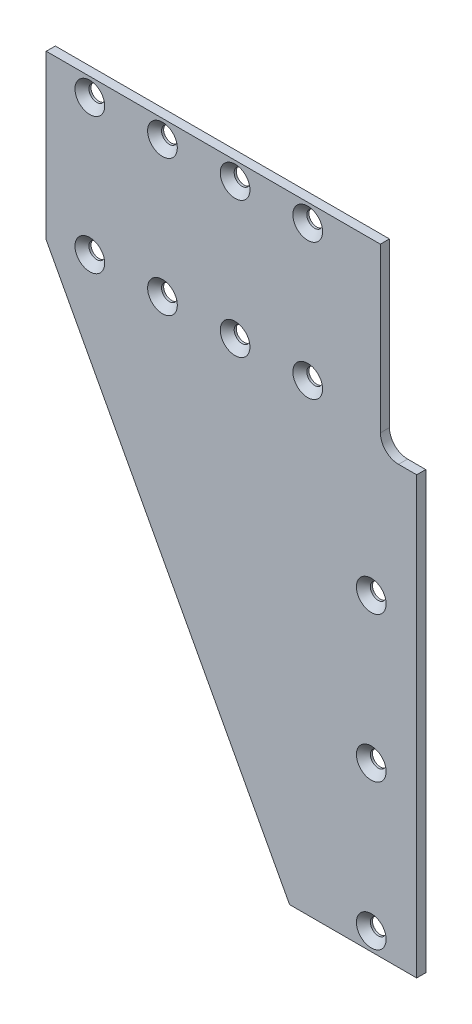
ISO-10303-21;
HEADER;
FILE_DESCRIPTION(('STEP AP214'),'2;1');
FILE_NAME('part.step','',(''),(''),'','','');
FILE_SCHEMA(('AUTOMOTIVE_DESIGN { 1 0 10303 214 1 1 1 1 }'));
ENDSEC;
DATA;
#1=APPLICATION_CONTEXT('core data for automotive mechanical design processes');
#2=APPLICATION_PROTOCOL_DEFINITION('international standard','automotive_design',2000,#1);
#3=PRODUCT_CONTEXT('',#1,'mechanical');
#4=PRODUCT('Part','Part','',(#3));
#5=PRODUCT_RELATED_PRODUCT_CATEGORY('part','',(#4));
#6=PRODUCT_DEFINITION_FORMATION('','',#4);
#7=PRODUCT_DEFINITION_CONTEXT('part definition',#1,'design');
#8=PRODUCT_DEFINITION('design','',#6,#7);
#9=PRODUCT_DEFINITION_SHAPE('','',#8);
#10=(LENGTH_UNIT() NAMED_UNIT(*) SI_UNIT(.MILLI.,.METRE.));
#11=(NAMED_UNIT(*) PLANE_ANGLE_UNIT() SI_UNIT($,.RADIAN.));
#12=(NAMED_UNIT(*) SI_UNIT($,.STERADIAN.) SOLID_ANGLE_UNIT());
#13=UNCERTAINTY_MEASURE_WITH_UNIT(LENGTH_MEASURE(1.E-05),#10,'distance_accuracy_value','');
#14=(GEOMETRIC_REPRESENTATION_CONTEXT(3) GLOBAL_UNCERTAINTY_ASSIGNED_CONTEXT((#13)) GLOBAL_UNIT_ASSIGNED_CONTEXT((#10,
#11,#12)) REPRESENTATION_CONTEXT('',''));
#15=CARTESIAN_POINT('',(0.,0.,0.));
#16=DIRECTION('',(0.,0.,1.));
#17=DIRECTION('',(1.,0.,0.));
#18=AXIS2_PLACEMENT_3D('',#15,#16,#17);
#19=CARTESIAN_POINT('',(-44.45,0.,-3.175));
#20=DIRECTION('',(0.,-1.,0.));
#21=DIRECTION('',(0.,0.,-1.));
#22=AXIS2_PLACEMENT_3D('',#19,#20,#21);
#23=PLANE('',#22);
#24=DIRECTION('',(1.,0.,0.));
#25=VECTOR('',#24,1.);
#26=CARTESIAN_POINT('',(-44.45,0.,0.));
#27=LINE('',#26,#25);
#28=CARTESIAN_POINT('',(-44.45,0.,0.));
#29=VERTEX_POINT('',#28);
#30=CARTESIAN_POINT('',(0.,0.,0.));
#31=VERTEX_POINT('',#30);
#32=EDGE_CURVE('E137',#29,#31,#27,.T.);
#33=ORIENTED_EDGE('',*,*,#32,.F.);
#34=DIRECTION('',(0.,0.,1.));
#35=VECTOR('',#34,1.);
#36=CARTESIAN_POINT('',(-44.45,0.,-3.175));
#37=LINE('',#36,#35);
#38=CARTESIAN_POINT('',(-44.45,0.,-3.175));
#39=VERTEX_POINT('',#38);
#40=EDGE_CURVE('E11',#39,#29,#37,.T.);
#41=ORIENTED_EDGE('',*,*,#40,.F.);
#42=DIRECTION('',(1.,0.,0.));
#43=VECTOR('',#42,1.);
#44=CARTESIAN_POINT('',(-44.45,0.,-3.175));
#45=LINE('',#44,#43);
#46=CARTESIAN_POINT('',(0.,0.,-3.175));
#47=VERTEX_POINT('',#46);
#48=EDGE_CURVE('E158',#39,#47,#45,.T.);
#49=ORIENTED_EDGE('',*,*,#48,.T.);
#50=DIRECTION('',(0.,0.,1.));
#51=VECTOR('',#50,1.);
#52=CARTESIAN_POINT('',(0.,0.,-3.175));
#53=LINE('',#52,#51);
#54=EDGE_CURVE('E43',#47,#31,#53,.T.);
#55=ORIENTED_EDGE('',*,*,#54,.T.);
#56=EDGE_LOOP('',(#33,#41,#49,#55));
#57=FACE_BOUND('',#56,.T.);
#58=ADVANCED_FACE('F40',(#57),#23,.T.);
#59=CARTESIAN_POINT('',(-129.54,158.75,-3.175));
#60=DIRECTION('',(-0.881375126691514,-0.472417067906652,0.));
#61=DIRECTION('',(0.472417067906652,-0.881375126691514,0.));
#62=AXIS2_PLACEMENT_3D('',#59,#60,#61);
#63=PLANE('',#62);
#64=DIRECTION('',(0.472417067906652,-0.881375126691514,0.));
#65=VECTOR('',#64,1.);
#66=CARTESIAN_POINT('',(-129.54,158.75,0.));
#67=LINE('',#66,#65);
#68=CARTESIAN_POINT('',(-129.54,158.75,0.));
#69=VERTEX_POINT('',#68);
#70=EDGE_CURVE('E156',#69,#29,#67,.T.);
#71=ORIENTED_EDGE('',*,*,#70,.F.);
#72=DIRECTION('',(0.,0.,1.));
#73=VECTOR('',#72,1.);
#74=CARTESIAN_POINT('',(-129.54,158.75,-3.175));
#75=LINE('',#74,#73);
#76=CARTESIAN_POINT('',(-129.54,158.75,-3.175));
#77=VERTEX_POINT('',#76);
#78=EDGE_CURVE('E49',#77,#69,#75,.T.);
#79=ORIENTED_EDGE('',*,*,#78,.F.);
#80=DIRECTION('',(0.472417067906652,-0.881375126691514,0.));
#81=VECTOR('',#80,1.);
#82=CARTESIAN_POINT('',(-129.54,158.75,-3.175));
#83=LINE('',#82,#81);
#84=EDGE_CURVE('E127',#77,#39,#83,.T.);
#85=ORIENTED_EDGE('',*,*,#84,.T.);
#86=ORIENTED_EDGE('',*,*,#40,.T.);
#87=EDGE_LOOP('',(#71,#79,#85,#86));
#88=FACE_BOUND('',#87,.T.);
#89=ADVANCED_FACE('F170',(#88),#63,.T.);
#90=CARTESIAN_POINT('',(-129.54,215.9,-3.175));
#91=DIRECTION('',(-1.,0.,0.));
#92=DIRECTION('',(0.,-1.,0.));
#93=AXIS2_PLACEMENT_3D('',#90,#91,#92);
#94=PLANE('',#93);
#95=DIRECTION('',(0.,-1.,0.));
#96=VECTOR('',#95,1.);
#97=CARTESIAN_POINT('',(-129.54,215.9,0.));
#98=LINE('',#97,#96);
#99=CARTESIAN_POINT('',(-129.54,215.9,0.));
#100=VERTEX_POINT('',#99);
#101=EDGE_CURVE('E114',#100,#69,#98,.T.);
#102=ORIENTED_EDGE('',*,*,#101,.F.);
#103=DIRECTION('',(0.,0.,1.));
#104=VECTOR('',#103,1.);
#105=CARTESIAN_POINT('',(-129.54,215.9,-3.175));
#106=LINE('',#105,#104);
#107=CARTESIAN_POINT('',(-129.54,215.9,-3.175));
#108=VERTEX_POINT('',#107);
#109=EDGE_CURVE('E109',#108,#100,#106,.T.);
#110=ORIENTED_EDGE('',*,*,#109,.F.);
#111=DIRECTION('',(0.,-1.,0.));
#112=VECTOR('',#111,1.);
#113=CARTESIAN_POINT('',(-129.54,215.9,-3.175));
#114=LINE('',#113,#112);
#115=EDGE_CURVE('E112',#108,#77,#114,.T.);
#116=ORIENTED_EDGE('',*,*,#115,.T.);
#117=ORIENTED_EDGE('',*,*,#78,.T.);
#118=EDGE_LOOP('',(#102,#110,#116,#117));
#119=FACE_BOUND('',#118,.T.);
#120=ADVANCED_FACE('F111',(#119),#94,.T.);
#121=CARTESIAN_POINT('',(-12.7,215.9,-3.175));
#122=DIRECTION('',(0.,1.,0.));
#123=DIRECTION('',(-1.,0.,0.));
#124=AXIS2_PLACEMENT_3D('',#121,#122,#123);
#125=PLANE('',#124);
#126=DIRECTION('',(-1.,0.,0.));
#127=VECTOR('',#126,1.);
#128=CARTESIAN_POINT('',(-12.7,215.9,0.));
#129=LINE('',#128,#127);
#130=CARTESIAN_POINT('',(-12.7,215.9,0.));
#131=VERTEX_POINT('',#130);
#132=EDGE_CURVE('E153',#131,#100,#129,.T.);
#133=ORIENTED_EDGE('',*,*,#132,.F.);
#134=DIRECTION('',(0.,0.,1.));
#135=VECTOR('',#134,1.);
#136=CARTESIAN_POINT('',(-12.7,215.9,-3.175));
#137=LINE('',#136,#135);
#138=CARTESIAN_POINT('',(-12.7,215.9,-3.175));
#139=VERTEX_POINT('',#138);
#140=EDGE_CURVE('E119',#139,#131,#137,.T.);
#141=ORIENTED_EDGE('',*,*,#140,.F.);
#142=DIRECTION('',(-1.,0.,0.));
#143=VECTOR('',#142,1.);
#144=CARTESIAN_POINT('',(-12.7,215.9,-3.175));
#145=LINE('',#144,#143);
#146=EDGE_CURVE('E125',#139,#108,#145,.T.);
#147=ORIENTED_EDGE('',*,*,#146,.T.);
#148=ORIENTED_EDGE('',*,*,#109,.T.);
#149=EDGE_LOOP('',(#133,#141,#147,#148));
#150=FACE_BOUND('',#149,.T.);
#151=ADVANCED_FACE('F129',(#150),#125,.T.);
#152=CARTESIAN_POINT('',(-12.7,215.9,-3.175));
#153=DIRECTION('',(1.,0.,0.));
#154=DIRECTION('',(0.,1.,0.));
#155=AXIS2_PLACEMENT_3D('',#152,#153,#154);
#156=PLANE('',#155);
#157=DIRECTION('',(0.,1.,0.));
#158=VECTOR('',#157,1.);
#159=CARTESIAN_POINT('',(-12.7,215.9,0.));
#160=LINE('',#159,#158);
#161=CARTESIAN_POINT('',(-12.7,158.75,0.));
#162=VERTEX_POINT('',#161);
#163=EDGE_CURVE('E150',#162,#131,#160,.T.);
#164=ORIENTED_EDGE('',*,*,#163,.F.);
#165=DIRECTION('',(0.,0.,1.));
#166=VECTOR('',#165,1.);
#167=CARTESIAN_POINT('',(-12.7,158.75,-3.175));
#168=LINE('',#167,#166);
#169=CARTESIAN_POINT('',(-12.7,158.75,-3.175));
#170=VERTEX_POINT('',#169);
#171=EDGE_CURVE('E162',#170,#162,#168,.T.);
#172=ORIENTED_EDGE('',*,*,#171,.F.);
#173=DIRECTION('',(0.,1.,0.));
#174=VECTOR('',#173,1.);
#175=CARTESIAN_POINT('',(-12.7,215.9,-3.175));
#176=LINE('',#175,#174);
#177=EDGE_CURVE('E130',#170,#139,#176,.T.);
#178=ORIENTED_EDGE('',*,*,#177,.T.);
#179=ORIENTED_EDGE('',*,*,#140,.T.);
#180=EDGE_LOOP('',(#164,#172,#178,#179));
#181=FACE_BOUND('',#180,.T.);
#182=ADVANCED_FACE('F183',(#181),#156,.T.);
#183=CARTESIAN_POINT('',(-6.35,158.75,-3.175));
#184=DIRECTION('',(0.,0.,1.));
#185=DIRECTION('',(1.,0.,0.));
#186=AXIS2_PLACEMENT_3D('',#183,#184,#185);
#187=CYLINDRICAL_SURFACE('',#186,6.35);
#188=CARTESIAN_POINT('',(-6.35,158.75,0.));
#189=DIRECTION('',(0.,0.,-1.));
#190=DIRECTION('',(1.,0.,0.));
#191=AXIS2_PLACEMENT_3D('',#188,#189,#190);
#192=CIRCLE('',#191,6.35);
#193=CARTESIAN_POINT('',(-6.34999999999994,152.4,0.));
#194=VERTEX_POINT('',#193);
#195=EDGE_CURVE('E147',#194,#162,#192,.T.);
#196=ORIENTED_EDGE('',*,*,#195,.F.);
#197=DIRECTION('',(0.,0.,1.));
#198=VECTOR('',#197,1.);
#199=CARTESIAN_POINT('',(-6.34999999999994,152.4,-3.175));
#200=LINE('',#199,#198);
#201=CARTESIAN_POINT('',(-6.34999999999994,152.4,-3.175));
#202=VERTEX_POINT('',#201);
#203=EDGE_CURVE('E164',#202,#194,#200,.T.);
#204=ORIENTED_EDGE('',*,*,#203,.F.);
#205=CARTESIAN_POINT('',(-6.35,158.75,-3.175));
#206=DIRECTION('',(0.,0.,-1.));
#207=DIRECTION('',(1.,0.,0.));
#208=AXIS2_PLACEMENT_3D('',#205,#206,#207);
#209=CIRCLE('',#208,6.35);
#210=EDGE_CURVE('E132',#202,#170,#209,.T.);
#211=ORIENTED_EDGE('',*,*,#210,.T.);
#212=ORIENTED_EDGE('',*,*,#171,.T.);
#213=EDGE_LOOP('',(#196,#204,#211,#212));
#214=FACE_BOUND('',#213,.T.);
#215=ADVANCED_FACE('F186',(#214),#187,.F.);
#216=CARTESIAN_POINT('',(-6.34999999999994,152.4,-3.175));
#217=DIRECTION('',(0.,1.,0.));
#218=DIRECTION('',(0.,0.,1.));
#219=AXIS2_PLACEMENT_3D('',#216,#217,#218);
#220=PLANE('',#219);
#221=DIRECTION('',(-1.,0.,0.));
#222=VECTOR('',#221,1.);
#223=CARTESIAN_POINT('',(-6.34999999999994,152.4,0.));
#224=LINE('',#223,#222);
#225=CARTESIAN_POINT('',(0.,152.4,0.));
#226=VERTEX_POINT('',#225);
#227=EDGE_CURVE('E144',#226,#194,#224,.T.);
#228=ORIENTED_EDGE('',*,*,#227,.F.);
#229=DIRECTION('',(0.,0.,1.));
#230=VECTOR('',#229,1.);
#231=CARTESIAN_POINT('',(0.,152.4,-3.175));
#232=LINE('',#231,#230);
#233=CARTESIAN_POINT('',(0.,152.4,-3.175));
#234=VERTEX_POINT('',#233);
#235=EDGE_CURVE('E165',#234,#226,#232,.T.);
#236=ORIENTED_EDGE('',*,*,#235,.F.);
#237=DIRECTION('',(-1.,0.,0.));
#238=VECTOR('',#237,1.);
#239=CARTESIAN_POINT('',(-6.34999999999994,152.4,-3.175));
#240=LINE('',#239,#238);
#241=EDGE_CURVE('E399',#234,#202,#240,.T.);
#242=ORIENTED_EDGE('',*,*,#241,.T.);
#243=ORIENTED_EDGE('',*,*,#203,.T.);
#244=EDGE_LOOP('',(#228,#236,#242,#243));
#245=FACE_BOUND('',#244,.T.);
#246=ADVANCED_FACE('F190',(#245),#220,.T.);
#247=CARTESIAN_POINT('',(0.,0.,-3.175));
#248=DIRECTION('',(1.,0.,0.));
#249=DIRECTION('',(0.,0.,-1.));
#250=AXIS2_PLACEMENT_3D('',#247,#248,#249);
#251=PLANE('',#250);
#252=DIRECTION('',(0.,1.,0.));
#253=VECTOR('',#252,1.);
#254=CARTESIAN_POINT('',(0.,0.,0.));
#255=LINE('',#254,#253);
#256=EDGE_CURVE('E140',#31,#226,#255,.T.);
#257=ORIENTED_EDGE('',*,*,#256,.F.);
#258=ORIENTED_EDGE('',*,*,#54,.F.);
#259=DIRECTION('',(0.,1.,0.));
#260=VECTOR('',#259,1.);
#261=CARTESIAN_POINT('',(0.,0.,-3.175));
#262=LINE('',#261,#260);
#263=EDGE_CURVE('E397',#47,#234,#262,.T.);
#264=ORIENTED_EDGE('',*,*,#263,.T.);
#265=ORIENTED_EDGE('',*,*,#235,.T.);
#266=EDGE_LOOP('',(#257,#258,#264,#265));
#267=FACE_BOUND('',#266,.T.);
#268=ADVANCED_FACE('F167',(#267),#251,.T.);
#269=CARTESIAN_POINT('',(-6.35,158.75,-3.175));
#270=DIRECTION('',(0.,0.,1.));
#271=DIRECTION('',(1.,0.,0.));
#272=AXIS2_PLACEMENT_3D('',#269,#270,#271);
#273=PLANE('',#272);
#274=CARTESIAN_POINT('',(-15.875,6.34999999999999,-3.175));
#275=DIRECTION('',(0.,0.,1.));
#276=DIRECTION('',(1.,0.,0.));
#277=AXIS2_PLACEMENT_3D('',#274,#275,#276);
#278=CIRCLE('',#277,2.75589999999999);
#279=CARTESIAN_POINT('',(-13.1191,6.34999999999999,-3.175));
#280=VERTEX_POINT('',#279);
#281=EDGE_CURVE('E303',#280,#280,#278,.T.);
#282=ORIENTED_EDGE('',*,*,#281,.T.);
#283=EDGE_LOOP('',(#282));
#284=FACE_BOUND('',#283,.T.);
#285=CARTESIAN_POINT('',(-15.875,57.15,-3.175));
#286=DIRECTION('',(0.,0.,1.));
#287=DIRECTION('',(1.,0.,0.));
#288=AXIS2_PLACEMENT_3D('',#285,#286,#287);
#289=CIRCLE('',#288,2.75589999999999);
#290=CARTESIAN_POINT('',(-13.1191,57.15,-3.175));
#291=VERTEX_POINT('',#290);
#292=EDGE_CURVE('E313',#291,#291,#289,.T.);
#293=ORIENTED_EDGE('',*,*,#292,.T.);
#294=EDGE_LOOP('',(#293));
#295=FACE_BOUND('',#294,.T.);
#296=CARTESIAN_POINT('',(-15.875,107.95,-3.175));
#297=DIRECTION('',(0.,0.,1.));
#298=DIRECTION('',(1.,0.,0.));
#299=AXIS2_PLACEMENT_3D('',#296,#297,#298);
#300=CIRCLE('',#299,2.75589999999999);
#301=CARTESIAN_POINT('',(-13.1191,107.95,-3.175));
#302=VERTEX_POINT('',#301);
#303=EDGE_CURVE('E322',#302,#302,#300,.T.);
#304=ORIENTED_EDGE('',*,*,#303,.T.);
#305=EDGE_LOOP('',(#304));
#306=FACE_BOUND('',#305,.T.);
#307=CARTESIAN_POINT('',(-38.1,209.55,-3.175));
#308=DIRECTION('',(0.,0.,1.));
#309=DIRECTION('',(1.,0.,0.));
#310=AXIS2_PLACEMENT_3D('',#307,#308,#309);
#311=CIRCLE('',#310,2.7559);
#312=CARTESIAN_POINT('',(-35.3441,209.55,-3.175));
#313=VERTEX_POINT('',#312);
#314=EDGE_CURVE('E331',#313,#313,#311,.T.);
#315=ORIENTED_EDGE('',*,*,#314,.T.);
#316=EDGE_LOOP('',(#315));
#317=FACE_BOUND('',#316,.T.);
#318=CARTESIAN_POINT('',(-38.1,161.925,-3.175));
#319=DIRECTION('',(0.,0.,1.));
#320=DIRECTION('',(1.,0.,0.));
#321=AXIS2_PLACEMENT_3D('',#318,#319,#320);
#322=CIRCLE('',#321,2.7559);
#323=CARTESIAN_POINT('',(-35.3441,161.925,-3.175));
#324=VERTEX_POINT('',#323);
#325=EDGE_CURVE('E340',#324,#324,#322,.T.);
#326=ORIENTED_EDGE('',*,*,#325,.T.);
#327=EDGE_LOOP('',(#326));
#328=FACE_BOUND('',#327,.T.);
#329=CARTESIAN_POINT('',(-63.5,209.55,-3.175));
#330=DIRECTION('',(0.,0.,1.));
#331=DIRECTION('',(1.,0.,0.));
#332=AXIS2_PLACEMENT_3D('',#329,#330,#331);
#333=CIRCLE('',#332,2.7559);
#334=CARTESIAN_POINT('',(-60.7441,209.55,-3.175));
#335=VERTEX_POINT('',#334);
#336=EDGE_CURVE('E349',#335,#335,#333,.T.);
#337=ORIENTED_EDGE('',*,*,#336,.T.);
#338=EDGE_LOOP('',(#337));
#339=FACE_BOUND('',#338,.T.);
#340=CARTESIAN_POINT('',(-63.5,161.925,-3.175));
#341=DIRECTION('',(0.,0.,1.));
#342=DIRECTION('',(1.,0.,0.));
#343=AXIS2_PLACEMENT_3D('',#340,#341,#342);
#344=CIRCLE('',#343,2.7559);
#345=CARTESIAN_POINT('',(-60.7441,161.925,-3.175));
#346=VERTEX_POINT('',#345);
#347=EDGE_CURVE('E358',#346,#346,#344,.T.);
#348=ORIENTED_EDGE('',*,*,#347,.T.);
#349=EDGE_LOOP('',(#348));
#350=FACE_BOUND('',#349,.T.);
#351=CARTESIAN_POINT('',(-88.9,209.55,-3.175));
#352=DIRECTION('',(0.,0.,1.));
#353=DIRECTION('',(1.,0.,0.));
#354=AXIS2_PLACEMENT_3D('',#351,#352,#353);
#355=CIRCLE('',#354,2.75590000000001);
#356=CARTESIAN_POINT('',(-86.1441,209.55,-3.175));
#357=VERTEX_POINT('',#356);
#358=EDGE_CURVE('E367',#357,#357,#355,.T.);
#359=ORIENTED_EDGE('',*,*,#358,.T.);
#360=EDGE_LOOP('',(#359));
#361=FACE_BOUND('',#360,.T.);
#362=CARTESIAN_POINT('',(-88.9,161.925,-3.175));
#363=DIRECTION('',(0.,0.,1.));
#364=DIRECTION('',(1.,0.,0.));
#365=AXIS2_PLACEMENT_3D('',#362,#363,#364);
#366=CIRCLE('',#365,2.75590000000001);
#367=CARTESIAN_POINT('',(-86.1441,161.925,-3.175));
#368=VERTEX_POINT('',#367);
#369=EDGE_CURVE('E376',#368,#368,#366,.T.);
#370=ORIENTED_EDGE('',*,*,#369,.T.);
#371=EDGE_LOOP('',(#370));
#372=FACE_BOUND('',#371,.T.);
#373=CARTESIAN_POINT('',(-114.3,209.55,-3.175));
#374=DIRECTION('',(0.,0.,1.));
#375=DIRECTION('',(1.,0.,0.));
#376=AXIS2_PLACEMENT_3D('',#373,#374,#375);
#377=CIRCLE('',#376,2.75590000000001);
#378=CARTESIAN_POINT('',(-111.5441,209.55,-3.175));
#379=VERTEX_POINT('',#378);
#380=EDGE_CURVE('E385',#379,#379,#377,.T.);
#381=ORIENTED_EDGE('',*,*,#380,.T.);
#382=EDGE_LOOP('',(#381));
#383=FACE_BOUND('',#382,.T.);
#384=CARTESIAN_POINT('',(-114.3,161.925,-3.175));
#385=DIRECTION('',(0.,0.,1.));
#386=DIRECTION('',(1.,0.,0.));
#387=AXIS2_PLACEMENT_3D('',#384,#385,#386);
#388=CIRCLE('',#387,2.75590000000001);
#389=CARTESIAN_POINT('',(-111.5441,161.925,-3.175));
#390=VERTEX_POINT('',#389);
#391=EDGE_CURVE('E141',#390,#390,#388,.T.);
#392=ORIENTED_EDGE('',*,*,#391,.T.);
#393=EDGE_LOOP('',(#392));
#394=FACE_BOUND('',#393,.T.);
#395=ORIENTED_EDGE('',*,*,#48,.F.);
#396=ORIENTED_EDGE('',*,*,#84,.F.);
#397=ORIENTED_EDGE('',*,*,#115,.F.);
#398=ORIENTED_EDGE('',*,*,#146,.F.);
#399=ORIENTED_EDGE('',*,*,#177,.F.);
#400=ORIENTED_EDGE('',*,*,#210,.F.);
#401=ORIENTED_EDGE('',*,*,#241,.F.);
#402=ORIENTED_EDGE('',*,*,#263,.F.);
#403=EDGE_LOOP('',(#395,#396,#397,#398,#399,#400,#401,#402));
#404=FACE_BOUND('',#403,.T.);
#405=ADVANCED_FACE('F123',(#284,#295,#306,#317,#328,#339,#350,#361,#372,#383,#394,#404),#273,.F.);
#406=CARTESIAN_POINT('',(-6.35,158.75,0.));
#407=DIRECTION('',(0.,0.,1.));
#408=DIRECTION('',(1.,0.,0.));
#409=AXIS2_PLACEMENT_3D('',#406,#407,#408);
#410=PLANE('',#409);
#411=CARTESIAN_POINT('',(-15.875,6.34999999999999,0.));
#412=DIRECTION('',(0.,0.,1.));
#413=DIRECTION('',(1.,0.,0.));
#414=AXIS2_PLACEMENT_3D('',#411,#412,#413);
#415=CIRCLE('',#414,5.1943);
#416=CARTESIAN_POINT('',(-10.6807,6.34999999999999,0.));
#417=VERTEX_POINT('',#416);
#418=EDGE_CURVE('E301',#417,#417,#415,.T.);
#419=ORIENTED_EDGE('',*,*,#418,.F.);
#420=EDGE_LOOP('',(#419));
#421=FACE_BOUND('',#420,.T.);
#422=CARTESIAN_POINT('',(-15.875,57.15,0.));
#423=DIRECTION('',(0.,0.,1.));
#424=DIRECTION('',(1.,0.,0.));
#425=AXIS2_PLACEMENT_3D('',#422,#423,#424);
#426=CIRCLE('',#425,5.1943);
#427=CARTESIAN_POINT('',(-10.6807,57.15,0.));
#428=VERTEX_POINT('',#427);
#429=EDGE_CURVE('E307',#428,#428,#426,.T.);
#430=ORIENTED_EDGE('',*,*,#429,.F.);
#431=EDGE_LOOP('',(#430));
#432=FACE_BOUND('',#431,.T.);
#433=CARTESIAN_POINT('',(-15.875,107.95,0.));
#434=DIRECTION('',(0.,0.,1.));
#435=DIRECTION('',(1.,0.,0.));
#436=AXIS2_PLACEMENT_3D('',#433,#434,#435);
#437=CIRCLE('',#436,5.1943);
#438=CARTESIAN_POINT('',(-10.6807,107.95,0.));
#439=VERTEX_POINT('',#438);
#440=EDGE_CURVE('E316',#439,#439,#437,.T.);
#441=ORIENTED_EDGE('',*,*,#440,.F.);
#442=EDGE_LOOP('',(#441));
#443=FACE_BOUND('',#442,.T.);
#444=CARTESIAN_POINT('',(-38.1,209.55,0.));
#445=DIRECTION('',(0.,0.,1.));
#446=DIRECTION('',(1.,0.,0.));
#447=AXIS2_PLACEMENT_3D('',#444,#445,#446);
#448=CIRCLE('',#447,5.1943);
#449=CARTESIAN_POINT('',(-32.9057,209.55,0.));
#450=VERTEX_POINT('',#449);
#451=EDGE_CURVE('E325',#450,#450,#448,.T.);
#452=ORIENTED_EDGE('',*,*,#451,.F.);
#453=EDGE_LOOP('',(#452));
#454=FACE_BOUND('',#453,.T.);
#455=CARTESIAN_POINT('',(-38.1,161.925,0.));
#456=DIRECTION('',(0.,0.,1.));
#457=DIRECTION('',(1.,0.,0.));
#458=AXIS2_PLACEMENT_3D('',#455,#456,#457);
#459=CIRCLE('',#458,5.1943);
#460=CARTESIAN_POINT('',(-32.9057,161.925,0.));
#461=VERTEX_POINT('',#460);
#462=EDGE_CURVE('E334',#461,#461,#459,.T.);
#463=ORIENTED_EDGE('',*,*,#462,.F.);
#464=EDGE_LOOP('',(#463));
#465=FACE_BOUND('',#464,.T.);
#466=CARTESIAN_POINT('',(-63.5,209.55,0.));
#467=DIRECTION('',(0.,0.,1.));
#468=DIRECTION('',(1.,0.,0.));
#469=AXIS2_PLACEMENT_3D('',#466,#467,#468);
#470=CIRCLE('',#469,5.1943);
#471=CARTESIAN_POINT('',(-58.3057,209.55,0.));
#472=VERTEX_POINT('',#471);
#473=EDGE_CURVE('E343',#472,#472,#470,.T.);
#474=ORIENTED_EDGE('',*,*,#473,.F.);
#475=EDGE_LOOP('',(#474));
#476=FACE_BOUND('',#475,.T.);
#477=CARTESIAN_POINT('',(-63.5,161.925,0.));
#478=DIRECTION('',(0.,0.,1.));
#479=DIRECTION('',(1.,0.,0.));
#480=AXIS2_PLACEMENT_3D('',#477,#478,#479);
#481=CIRCLE('',#480,5.1943);
#482=CARTESIAN_POINT('',(-58.3057,161.925,0.));
#483=VERTEX_POINT('',#482);
#484=EDGE_CURVE('E352',#483,#483,#481,.T.);
#485=ORIENTED_EDGE('',*,*,#484,.F.);
#486=EDGE_LOOP('',(#485));
#487=FACE_BOUND('',#486,.T.);
#488=CARTESIAN_POINT('',(-88.9,209.55,0.));
#489=DIRECTION('',(0.,0.,1.));
#490=DIRECTION('',(1.,0.,0.));
#491=AXIS2_PLACEMENT_3D('',#488,#489,#490);
#492=CIRCLE('',#491,5.1943);
#493=CARTESIAN_POINT('',(-83.7057,209.55,0.));
#494=VERTEX_POINT('',#493);
#495=EDGE_CURVE('E361',#494,#494,#492,.T.);
#496=ORIENTED_EDGE('',*,*,#495,.F.);
#497=EDGE_LOOP('',(#496));
#498=FACE_BOUND('',#497,.T.);
#499=CARTESIAN_POINT('',(-88.9,161.925,0.));
#500=DIRECTION('',(0.,0.,1.));
#501=DIRECTION('',(1.,0.,0.));
#502=AXIS2_PLACEMENT_3D('',#499,#500,#501);
#503=CIRCLE('',#502,5.1943);
#504=CARTESIAN_POINT('',(-83.7057,161.925,0.));
#505=VERTEX_POINT('',#504);
#506=EDGE_CURVE('E370',#505,#505,#503,.T.);
#507=ORIENTED_EDGE('',*,*,#506,.F.);
#508=EDGE_LOOP('',(#507));
#509=FACE_BOUND('',#508,.T.);
#510=CARTESIAN_POINT('',(-114.3,209.55,0.));
#511=DIRECTION('',(0.,0.,1.));
#512=DIRECTION('',(1.,0.,0.));
#513=AXIS2_PLACEMENT_3D('',#510,#511,#512);
#514=CIRCLE('',#513,5.1943);
#515=CARTESIAN_POINT('',(-109.1057,209.55,0.));
#516=VERTEX_POINT('',#515);
#517=EDGE_CURVE('E379',#516,#516,#514,.T.);
#518=ORIENTED_EDGE('',*,*,#517,.F.);
#519=EDGE_LOOP('',(#518));
#520=FACE_BOUND('',#519,.T.);
#521=CARTESIAN_POINT('',(-114.3,161.925,0.));
#522=DIRECTION('',(0.,0.,1.));
#523=DIRECTION('',(1.,0.,0.));
#524=AXIS2_PLACEMENT_3D('',#521,#522,#523);
#525=CIRCLE('',#524,5.1943);
#526=CARTESIAN_POINT('',(-109.1057,161.925,0.));
#527=VERTEX_POINT('',#526);
#528=EDGE_CURVE('E388',#527,#527,#525,.T.);
#529=ORIENTED_EDGE('',*,*,#528,.F.);
#530=EDGE_LOOP('',(#529));
#531=FACE_BOUND('',#530,.T.);
#532=ORIENTED_EDGE('',*,*,#32,.T.);
#533=ORIENTED_EDGE('',*,*,#256,.T.);
#534=ORIENTED_EDGE('',*,*,#227,.T.);
#535=ORIENTED_EDGE('',*,*,#195,.T.);
#536=ORIENTED_EDGE('',*,*,#163,.T.);
#537=ORIENTED_EDGE('',*,*,#132,.T.);
#538=ORIENTED_EDGE('',*,*,#101,.T.);
#539=ORIENTED_EDGE('',*,*,#70,.T.);
#540=EDGE_LOOP('',(#532,#533,#534,#535,#536,#537,#538,#539));
#541=FACE_BOUND('',#540,.T.);
#542=ADVANCED_FACE('F169',(#421,#432,#443,#454,#465,#476,#487,#498,#509,#520,#531,#541),#410,.T.);
#543=CARTESIAN_POINT('',(-114.3,161.925,0.));
#544=DIRECTION('',(0.,0.,1.));
#545=DIRECTION('',(1.,0.,0.));
#546=AXIS2_PLACEMENT_3D('',#543,#544,#545);
#547=CYLINDRICAL_SURFACE('',#546,2.75590000000001);
#548=ORIENTED_EDGE('',*,*,#391,.F.);
#549=EDGE_LOOP('',(#548));
#550=FACE_BOUND('',#549,.T.);
#551=CARTESIAN_POINT('',(-114.3,161.925,-2.4384));
#552=DIRECTION('',(0.,0.,1.));
#553=DIRECTION('',(1.,0.,0.));
#554=AXIS2_PLACEMENT_3D('',#551,#552,#553);
#555=CIRCLE('',#554,2.75590000000001);
#556=CARTESIAN_POINT('',(-111.5441,161.925,-2.4384));
#557=VERTEX_POINT('',#556);
#558=EDGE_CURVE('E391',#557,#557,#555,.T.);
#559=ORIENTED_EDGE('',*,*,#558,.T.);
#560=EDGE_LOOP('',(#559));
#561=FACE_BOUND('',#560,.T.);
#562=ADVANCED_FACE('F202',(#550,#561),#547,.F.);
#563=CARTESIAN_POINT('',(-114.3,161.925,0.));
#564=DIRECTION('',(0.,0.,1.));
#565=DIRECTION('',(1.,0.,0.));
#566=AXIS2_PLACEMENT_3D('',#563,#564,#565);
#567=CONICAL_SURFACE('',#566,5.1943,0.785398163397447);
#568=ORIENTED_EDGE('',*,*,#558,.F.);
#569=EDGE_LOOP('',(#568));
#570=FACE_BOUND('',#569,.T.);
#571=ORIENTED_EDGE('',*,*,#528,.T.);
#572=EDGE_LOOP('',(#571));
#573=FACE_BOUND('',#572,.T.);
#574=ADVANCED_FACE('F209',(#570,#573),#567,.F.);
#575=CARTESIAN_POINT('',(-114.3,209.55,0.));
#576=DIRECTION('',(0.,0.,1.));
#577=DIRECTION('',(1.,0.,0.));
#578=AXIS2_PLACEMENT_3D('',#575,#576,#577);
#579=CYLINDRICAL_SURFACE('',#578,2.75590000000001);
#580=ORIENTED_EDGE('',*,*,#380,.F.);
#581=EDGE_LOOP('',(#580));
#582=FACE_BOUND('',#581,.T.);
#583=CARTESIAN_POINT('',(-114.3,209.55,-2.4384));
#584=DIRECTION('',(0.,0.,1.));
#585=DIRECTION('',(1.,0.,0.));
#586=AXIS2_PLACEMENT_3D('',#583,#584,#585);
#587=CIRCLE('',#586,2.75590000000001);
#588=CARTESIAN_POINT('',(-111.5441,209.55,-2.4384));
#589=VERTEX_POINT('',#588);
#590=EDGE_CURVE('E382',#589,#589,#587,.T.);
#591=ORIENTED_EDGE('',*,*,#590,.T.);
#592=EDGE_LOOP('',(#591));
#593=FACE_BOUND('',#592,.T.);
#594=ADVANCED_FACE('F213',(#582,#593),#579,.F.);
#595=CARTESIAN_POINT('',(-114.3,209.55,0.));
#596=DIRECTION('',(0.,0.,1.));
#597=DIRECTION('',(1.,0.,0.));
#598=AXIS2_PLACEMENT_3D('',#595,#596,#597);
#599=CONICAL_SURFACE('',#598,5.1943,0.785398163397447);
#600=ORIENTED_EDGE('',*,*,#590,.F.);
#601=EDGE_LOOP('',(#600));
#602=FACE_BOUND('',#601,.T.);
#603=ORIENTED_EDGE('',*,*,#517,.T.);
#604=EDGE_LOOP('',(#603));
#605=FACE_BOUND('',#604,.T.);
#606=ADVANCED_FACE('F217',(#602,#605),#599,.F.);
#607=CARTESIAN_POINT('',(-88.9,161.925,0.));
#608=DIRECTION('',(0.,0.,1.));
#609=DIRECTION('',(1.,0.,0.));
#610=AXIS2_PLACEMENT_3D('',#607,#608,#609);
#611=CYLINDRICAL_SURFACE('',#610,2.75590000000001);
#612=ORIENTED_EDGE('',*,*,#369,.F.);
#613=EDGE_LOOP('',(#612));
#614=FACE_BOUND('',#613,.T.);
#615=CARTESIAN_POINT('',(-88.9,161.925,-2.4384));
#616=DIRECTION('',(0.,0.,1.));
#617=DIRECTION('',(1.,0.,0.));
#618=AXIS2_PLACEMENT_3D('',#615,#616,#617);
#619=CIRCLE('',#618,2.75590000000001);
#620=CARTESIAN_POINT('',(-86.1441,161.925,-2.4384));
#621=VERTEX_POINT('',#620);
#622=EDGE_CURVE('E373',#621,#621,#619,.T.);
#623=ORIENTED_EDGE('',*,*,#622,.T.);
#624=EDGE_LOOP('',(#623));
#625=FACE_BOUND('',#624,.T.);
#626=ADVANCED_FACE('F221',(#614,#625),#611,.F.);
#627=CARTESIAN_POINT('',(-88.9,161.925,0.));
#628=DIRECTION('',(0.,0.,1.));
#629=DIRECTION('',(1.,0.,0.));
#630=AXIS2_PLACEMENT_3D('',#627,#628,#629);
#631=CONICAL_SURFACE('',#630,5.1943,0.785398163397447);
#632=ORIENTED_EDGE('',*,*,#622,.F.);
#633=EDGE_LOOP('',(#632));
#634=FACE_BOUND('',#633,.T.);
#635=ORIENTED_EDGE('',*,*,#506,.T.);
#636=EDGE_LOOP('',(#635));
#637=FACE_BOUND('',#636,.T.);
#638=ADVANCED_FACE('F225',(#634,#637),#631,.F.);
#639=CARTESIAN_POINT('',(-88.9,209.55,0.));
#640=DIRECTION('',(0.,0.,1.));
#641=DIRECTION('',(1.,0.,0.));
#642=AXIS2_PLACEMENT_3D('',#639,#640,#641);
#643=CYLINDRICAL_SURFACE('',#642,2.75590000000001);
#644=ORIENTED_EDGE('',*,*,#358,.F.);
#645=EDGE_LOOP('',(#644));
#646=FACE_BOUND('',#645,.T.);
#647=CARTESIAN_POINT('',(-88.9,209.55,-2.4384));
#648=DIRECTION('',(0.,0.,1.));
#649=DIRECTION('',(1.,0.,0.));
#650=AXIS2_PLACEMENT_3D('',#647,#648,#649);
#651=CIRCLE('',#650,2.75590000000001);
#652=CARTESIAN_POINT('',(-86.1441,209.55,-2.4384));
#653=VERTEX_POINT('',#652);
#654=EDGE_CURVE('E364',#653,#653,#651,.T.);
#655=ORIENTED_EDGE('',*,*,#654,.T.);
#656=EDGE_LOOP('',(#655));
#657=FACE_BOUND('',#656,.T.);
#658=ADVANCED_FACE('F229',(#646,#657),#643,.F.);
#659=CARTESIAN_POINT('',(-88.9,209.55,0.));
#660=DIRECTION('',(0.,0.,1.));
#661=DIRECTION('',(1.,0.,0.));
#662=AXIS2_PLACEMENT_3D('',#659,#660,#661);
#663=CONICAL_SURFACE('',#662,5.1943,0.785398163397447);
#664=ORIENTED_EDGE('',*,*,#654,.F.);
#665=EDGE_LOOP('',(#664));
#666=FACE_BOUND('',#665,.T.);
#667=ORIENTED_EDGE('',*,*,#495,.T.);
#668=EDGE_LOOP('',(#667));
#669=FACE_BOUND('',#668,.T.);
#670=ADVANCED_FACE('F233',(#666,#669),#663,.F.);
#671=CARTESIAN_POINT('',(-63.5,161.925,0.));
#672=DIRECTION('',(0.,0.,1.));
#673=DIRECTION('',(1.,0.,0.));
#674=AXIS2_PLACEMENT_3D('',#671,#672,#673);
#675=CYLINDRICAL_SURFACE('',#674,2.7559);
#676=ORIENTED_EDGE('',*,*,#347,.F.);
#677=EDGE_LOOP('',(#676));
#678=FACE_BOUND('',#677,.T.);
#679=CARTESIAN_POINT('',(-63.5,161.925,-2.4384));
#680=DIRECTION('',(0.,0.,1.));
#681=DIRECTION('',(1.,0.,0.));
#682=AXIS2_PLACEMENT_3D('',#679,#680,#681);
#683=CIRCLE('',#682,2.7559);
#684=CARTESIAN_POINT('',(-60.7441,161.925,-2.4384));
#685=VERTEX_POINT('',#684);
#686=EDGE_CURVE('E355',#685,#685,#683,.T.);
#687=ORIENTED_EDGE('',*,*,#686,.T.);
#688=EDGE_LOOP('',(#687));
#689=FACE_BOUND('',#688,.T.);
#690=ADVANCED_FACE('F237',(#678,#689),#675,.F.);
#691=CARTESIAN_POINT('',(-63.5,161.925,0.));
#692=DIRECTION('',(0.,0.,1.));
#693=DIRECTION('',(1.,0.,0.));
#694=AXIS2_PLACEMENT_3D('',#691,#692,#693);
#695=CONICAL_SURFACE('',#694,5.1943,0.785398163397449);
#696=ORIENTED_EDGE('',*,*,#686,.F.);
#697=EDGE_LOOP('',(#696));
#698=FACE_BOUND('',#697,.T.);
#699=ORIENTED_EDGE('',*,*,#484,.T.);
#700=EDGE_LOOP('',(#699));
#701=FACE_BOUND('',#700,.T.);
#702=ADVANCED_FACE('F241',(#698,#701),#695,.F.);
#703=CARTESIAN_POINT('',(-63.5,209.55,0.));
#704=DIRECTION('',(0.,0.,1.));
#705=DIRECTION('',(1.,0.,0.));
#706=AXIS2_PLACEMENT_3D('',#703,#704,#705);
#707=CYLINDRICAL_SURFACE('',#706,2.7559);
#708=ORIENTED_EDGE('',*,*,#336,.F.);
#709=EDGE_LOOP('',(#708));
#710=FACE_BOUND('',#709,.T.);
#711=CARTESIAN_POINT('',(-63.5,209.55,-2.4384));
#712=DIRECTION('',(0.,0.,1.));
#713=DIRECTION('',(1.,0.,0.));
#714=AXIS2_PLACEMENT_3D('',#711,#712,#713);
#715=CIRCLE('',#714,2.7559);
#716=CARTESIAN_POINT('',(-60.7441,209.55,-2.4384));
#717=VERTEX_POINT('',#716);
#718=EDGE_CURVE('E346',#717,#717,#715,.T.);
#719=ORIENTED_EDGE('',*,*,#718,.T.);
#720=EDGE_LOOP('',(#719));
#721=FACE_BOUND('',#720,.T.);
#722=ADVANCED_FACE('F245',(#710,#721),#707,.F.);
#723=CARTESIAN_POINT('',(-63.5,209.55,0.));
#724=DIRECTION('',(0.,0.,1.));
#725=DIRECTION('',(1.,0.,0.));
#726=AXIS2_PLACEMENT_3D('',#723,#724,#725);
#727=CONICAL_SURFACE('',#726,5.1943,0.785398163397449);
#728=ORIENTED_EDGE('',*,*,#718,.F.);
#729=EDGE_LOOP('',(#728));
#730=FACE_BOUND('',#729,.T.);
#731=ORIENTED_EDGE('',*,*,#473,.T.);
#732=EDGE_LOOP('',(#731));
#733=FACE_BOUND('',#732,.T.);
#734=ADVANCED_FACE('F249',(#730,#733),#727,.F.);
#735=CARTESIAN_POINT('',(-38.1,161.925,0.));
#736=DIRECTION('',(0.,0.,1.));
#737=DIRECTION('',(1.,0.,0.));
#738=AXIS2_PLACEMENT_3D('',#735,#736,#737);
#739=CYLINDRICAL_SURFACE('',#738,2.7559);
#740=ORIENTED_EDGE('',*,*,#325,.F.);
#741=EDGE_LOOP('',(#740));
#742=FACE_BOUND('',#741,.T.);
#743=CARTESIAN_POINT('',(-38.1,161.925,-2.4384));
#744=DIRECTION('',(0.,0.,1.));
#745=DIRECTION('',(1.,0.,0.));
#746=AXIS2_PLACEMENT_3D('',#743,#744,#745);
#747=CIRCLE('',#746,2.7559);
#748=CARTESIAN_POINT('',(-35.3441,161.925,-2.4384));
#749=VERTEX_POINT('',#748);
#750=EDGE_CURVE('E337',#749,#749,#747,.T.);
#751=ORIENTED_EDGE('',*,*,#750,.T.);
#752=EDGE_LOOP('',(#751));
#753=FACE_BOUND('',#752,.T.);
#754=ADVANCED_FACE('F253',(#742,#753),#739,.F.);
#755=CARTESIAN_POINT('',(-38.1,161.925,0.));
#756=DIRECTION('',(0.,0.,1.));
#757=DIRECTION('',(1.,0.,0.));
#758=AXIS2_PLACEMENT_3D('',#755,#756,#757);
#759=CONICAL_SURFACE('',#758,5.1943,0.785398163397449);
#760=ORIENTED_EDGE('',*,*,#750,.F.);
#761=EDGE_LOOP('',(#760));
#762=FACE_BOUND('',#761,.T.);
#763=ORIENTED_EDGE('',*,*,#462,.T.);
#764=EDGE_LOOP('',(#763));
#765=FACE_BOUND('',#764,.T.);
#766=ADVANCED_FACE('F257',(#762,#765),#759,.F.);
#767=CARTESIAN_POINT('',(-38.1,209.55,0.));
#768=DIRECTION('',(0.,0.,1.));
#769=DIRECTION('',(1.,0.,0.));
#770=AXIS2_PLACEMENT_3D('',#767,#768,#769);
#771=CYLINDRICAL_SURFACE('',#770,2.7559);
#772=ORIENTED_EDGE('',*,*,#314,.F.);
#773=EDGE_LOOP('',(#772));
#774=FACE_BOUND('',#773,.T.);
#775=CARTESIAN_POINT('',(-38.1,209.55,-2.4384));
#776=DIRECTION('',(0.,0.,1.));
#777=DIRECTION('',(1.,0.,0.));
#778=AXIS2_PLACEMENT_3D('',#775,#776,#777);
#779=CIRCLE('',#778,2.7559);
#780=CARTESIAN_POINT('',(-35.3441,209.55,-2.4384));
#781=VERTEX_POINT('',#780);
#782=EDGE_CURVE('E328',#781,#781,#779,.T.);
#783=ORIENTED_EDGE('',*,*,#782,.T.);
#784=EDGE_LOOP('',(#783));
#785=FACE_BOUND('',#784,.T.);
#786=ADVANCED_FACE('F261',(#774,#785),#771,.F.);
#787=CARTESIAN_POINT('',(-38.1,209.55,0.));
#788=DIRECTION('',(0.,0.,1.));
#789=DIRECTION('',(1.,0.,0.));
#790=AXIS2_PLACEMENT_3D('',#787,#788,#789);
#791=CONICAL_SURFACE('',#790,5.1943,0.785398163397449);
#792=ORIENTED_EDGE('',*,*,#782,.F.);
#793=EDGE_LOOP('',(#792));
#794=FACE_BOUND('',#793,.T.);
#795=ORIENTED_EDGE('',*,*,#451,.T.);
#796=EDGE_LOOP('',(#795));
#797=FACE_BOUND('',#796,.T.);
#798=ADVANCED_FACE('F265',(#794,#797),#791,.F.);
#799=CARTESIAN_POINT('',(-15.875,107.95,0.));
#800=DIRECTION('',(0.,0.,1.));
#801=DIRECTION('',(1.,0.,0.));
#802=AXIS2_PLACEMENT_3D('',#799,#800,#801);
#803=CYLINDRICAL_SURFACE('',#802,2.75589999999999);
#804=ORIENTED_EDGE('',*,*,#303,.F.);
#805=EDGE_LOOP('',(#804));
#806=FACE_BOUND('',#805,.T.);
#807=CARTESIAN_POINT('',(-15.875,107.95,-2.43840000000001));
#808=DIRECTION('',(0.,0.,1.));
#809=DIRECTION('',(1.,0.,0.));
#810=AXIS2_PLACEMENT_3D('',#807,#808,#809);
#811=CIRCLE('',#810,2.75589999999999);
#812=CARTESIAN_POINT('',(-13.1191,107.95,-2.43840000000001));
#813=VERTEX_POINT('',#812);
#814=EDGE_CURVE('E319',#813,#813,#811,.T.);
#815=ORIENTED_EDGE('',*,*,#814,.T.);
#816=EDGE_LOOP('',(#815));
#817=FACE_BOUND('',#816,.T.);
#818=ADVANCED_FACE('F269',(#806,#817),#803,.F.);
#819=CARTESIAN_POINT('',(-15.875,107.95,0.));
#820=DIRECTION('',(0.,0.,1.));
#821=DIRECTION('',(1.,0.,0.));
#822=AXIS2_PLACEMENT_3D('',#819,#820,#821);
#823=CONICAL_SURFACE('',#822,5.1943,0.785398163397449);
#824=ORIENTED_EDGE('',*,*,#814,.F.);
#825=EDGE_LOOP('',(#824));
#826=FACE_BOUND('',#825,.T.);
#827=ORIENTED_EDGE('',*,*,#440,.T.);
#828=EDGE_LOOP('',(#827));
#829=FACE_BOUND('',#828,.T.);
#830=ADVANCED_FACE('F273',(#826,#829),#823,.F.);
#831=CARTESIAN_POINT('',(-15.875,57.15,0.));
#832=DIRECTION('',(0.,0.,1.));
#833=DIRECTION('',(1.,0.,0.));
#834=AXIS2_PLACEMENT_3D('',#831,#832,#833);
#835=CYLINDRICAL_SURFACE('',#834,2.75589999999999);
#836=ORIENTED_EDGE('',*,*,#292,.F.);
#837=EDGE_LOOP('',(#836));
#838=FACE_BOUND('',#837,.T.);
#839=CARTESIAN_POINT('',(-15.875,57.15,-2.43840000000001));
#840=DIRECTION('',(0.,0.,1.));
#841=DIRECTION('',(1.,0.,0.));
#842=AXIS2_PLACEMENT_3D('',#839,#840,#841);
#843=CIRCLE('',#842,2.75589999999999);
#844=CARTESIAN_POINT('',(-13.1191,57.15,-2.43840000000001));
#845=VERTEX_POINT('',#844);
#846=EDGE_CURVE('E310',#845,#845,#843,.T.);
#847=ORIENTED_EDGE('',*,*,#846,.T.);
#848=EDGE_LOOP('',(#847));
#849=FACE_BOUND('',#848,.T.);
#850=ADVANCED_FACE('F277',(#838,#849),#835,.F.);
#851=CARTESIAN_POINT('',(-15.875,57.15,0.));
#852=DIRECTION('',(0.,0.,1.));
#853=DIRECTION('',(1.,0.,0.));
#854=AXIS2_PLACEMENT_3D('',#851,#852,#853);
#855=CONICAL_SURFACE('',#854,5.1943,0.785398163397449);
#856=ORIENTED_EDGE('',*,*,#846,.F.);
#857=EDGE_LOOP('',(#856));
#858=FACE_BOUND('',#857,.T.);
#859=ORIENTED_EDGE('',*,*,#429,.T.);
#860=EDGE_LOOP('',(#859));
#861=FACE_BOUND('',#860,.T.);
#862=ADVANCED_FACE('F281',(#858,#861),#855,.F.);
#863=CARTESIAN_POINT('',(-15.875,6.34999999999999,0.));
#864=DIRECTION('',(0.,0.,1.));
#865=DIRECTION('',(1.,0.,0.));
#866=AXIS2_PLACEMENT_3D('',#863,#864,#865);
#867=CYLINDRICAL_SURFACE('',#866,2.75589999999999);
#868=ORIENTED_EDGE('',*,*,#281,.F.);
#869=EDGE_LOOP('',(#868));
#870=FACE_BOUND('',#869,.T.);
#871=CARTESIAN_POINT('',(-15.875,6.34999999999999,-2.43840000000001));
#872=DIRECTION('',(0.,0.,1.));
#873=DIRECTION('',(1.,0.,0.));
#874=AXIS2_PLACEMENT_3D('',#871,#872,#873);
#875=CIRCLE('',#874,2.75589999999999);
#876=CARTESIAN_POINT('',(-13.1191,6.34999999999999,-2.43840000000001));
#877=VERTEX_POINT('',#876);
#878=EDGE_CURVE('E298',#877,#877,#875,.T.);
#879=ORIENTED_EDGE('',*,*,#878,.T.);
#880=EDGE_LOOP('',(#879));
#881=FACE_BOUND('',#880,.T.);
#882=ADVANCED_FACE('F285',(#870,#881),#867,.F.);
#883=CARTESIAN_POINT('',(-15.875,6.34999999999999,0.));
#884=DIRECTION('',(0.,0.,1.));
#885=DIRECTION('',(1.,0.,0.));
#886=AXIS2_PLACEMENT_3D('',#883,#884,#885);
#887=CONICAL_SURFACE('',#886,5.1943,0.785398163397449);
#888=ORIENTED_EDGE('',*,*,#878,.F.);
#889=EDGE_LOOP('',(#888));
#890=FACE_BOUND('',#889,.T.);
#891=ORIENTED_EDGE('',*,*,#418,.T.);
#892=EDGE_LOOP('',(#891));
#893=FACE_BOUND('',#892,.T.);
#894=ADVANCED_FACE('F289',(#890,#893),#887,.F.);
#895=CLOSED_SHELL('',(#58,#89,#120,#151,#182,#215,#246,#268,#405,#542,#562,#574,#594,#606,#626,
#638,#658,#670,#690,#702,#722,#734,#754,#766,#786,#798,#818,#830,#850,#862,#882,#894));
#896=MANIFOLD_SOLID_BREP('B2',#895);
#897=ADVANCED_BREP_SHAPE_REPRESENTATION('',(#18,#896),#14);
#898=SHAPE_DEFINITION_REPRESENTATION(#9,#897);
ENDSEC;
END-ISO-10303-21;
